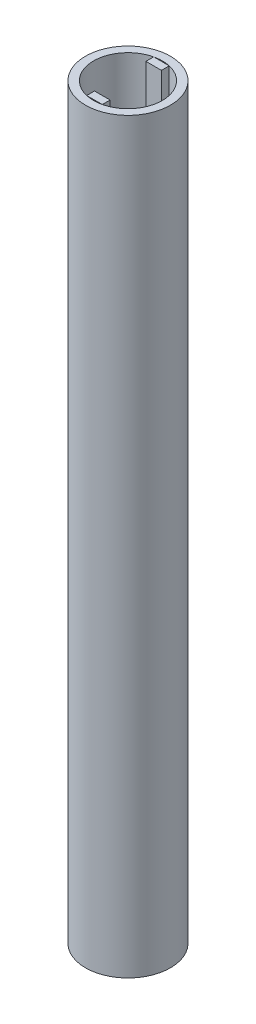
ISO-10303-21;
HEADER;
FILE_DESCRIPTION(('STEP AP214'),'2;1');
FILE_NAME('part.step','',(''),(''),'','','');
FILE_SCHEMA(('AUTOMOTIVE_DESIGN { 1 0 10303 214 1 1 1 1 }'));
ENDSEC;
DATA;
#1=APPLICATION_CONTEXT('core data for automotive mechanical design processes');
#2=APPLICATION_PROTOCOL_DEFINITION('international standard','automotive_design',2000,#1);
#3=PRODUCT_CONTEXT('',#1,'mechanical');
#4=PRODUCT('Part','Part','',(#3));
#5=PRODUCT_RELATED_PRODUCT_CATEGORY('part','',(#4));
#6=PRODUCT_DEFINITION_FORMATION('','',#4);
#7=PRODUCT_DEFINITION_CONTEXT('part definition',#1,'design');
#8=PRODUCT_DEFINITION('design','',#6,#7);
#9=PRODUCT_DEFINITION_SHAPE('','',#8);
#10=(LENGTH_UNIT() NAMED_UNIT(*) SI_UNIT(.MILLI.,.METRE.));
#11=(NAMED_UNIT(*) PLANE_ANGLE_UNIT() SI_UNIT($,.RADIAN.));
#12=(NAMED_UNIT(*) SI_UNIT($,.STERADIAN.) SOLID_ANGLE_UNIT());
#13=UNCERTAINTY_MEASURE_WITH_UNIT(LENGTH_MEASURE(1.E-05),#10,'distance_accuracy_value','');
#14=(GEOMETRIC_REPRESENTATION_CONTEXT(3) GLOBAL_UNCERTAINTY_ASSIGNED_CONTEXT((#13)) GLOBAL_UNIT_ASSIGNED_CONTEXT((#10,
#11,#12)) REPRESENTATION_CONTEXT('',''));
#15=CARTESIAN_POINT('',(0.,0.,0.));
#16=DIRECTION('',(0.,0.,1.));
#17=DIRECTION('',(1.,0.,0.));
#18=AXIS2_PLACEMENT_3D('',#15,#16,#17);
#19=CARTESIAN_POINT('',(6.35,482.6,27.3131622219032));
#20=DIRECTION('',(1.,0.,0.));
#21=DIRECTION('',(0.,0.,-1.));
#22=AXIS2_PLACEMENT_3D('',#19,#20,#21);
#23=PLANE('',#22);
#24=DIRECTION('',(0.,0.,-1.));
#25=VECTOR('',#24,1.);
#26=CARTESIAN_POINT('',(6.35,495.3,34.6593));
#27=LINE('',#26,#25);
#28=CARTESIAN_POINT('',(6.35,495.3,27.3131622219032));
#29=VERTEX_POINT('',#28);
#30=CARTESIAN_POINT('',(6.35,495.3,20.9631622219032));
#31=VERTEX_POINT('',#30);
#32=EDGE_CURVE('E108',#29,#31,#27,.T.);
#33=ORIENTED_EDGE('',*,*,#32,.T.);
#34=DIRECTION('',(0.,1.,0.));
#35=VECTOR('',#34,1.);
#36=CARTESIAN_POINT('',(6.35,482.6,20.9631622219032));
#37=LINE('',#36,#35);
#38=CARTESIAN_POINT('',(6.35,609.6,20.9631622219032));
#39=VERTEX_POINT('',#38);
#40=EDGE_CURVE('E47',#31,#39,#37,.T.);
#41=ORIENTED_EDGE('',*,*,#40,.T.);
#42=DIRECTION('',(0.,0.,-1.));
#43=VECTOR('',#42,1.);
#44=CARTESIAN_POINT('',(6.35,609.6,27.3131622219032));
#45=LINE('',#44,#43);
#46=CARTESIAN_POINT('',(6.35,609.6,27.3131622219032));
#47=VERTEX_POINT('',#46);
#48=EDGE_CURVE('E106',#47,#39,#45,.T.);
#49=ORIENTED_EDGE('',*,*,#48,.F.);
#50=DIRECTION('',(0.,1.,0.));
#51=VECTOR('',#50,1.);
#52=CARTESIAN_POINT('',(6.35,482.6,27.3131622219032));
#53=LINE('',#52,#51);
#54=EDGE_CURVE('E12',#29,#47,#53,.T.);
#55=ORIENTED_EDGE('',*,*,#54,.F.);
#56=EDGE_LOOP('',(#33,#41,#49,#55));
#57=FACE_BOUND('',#56,.T.);
#58=ADVANCED_FACE('F44',(#57),#23,.T.);
#59=CARTESIAN_POINT('',(6.35,482.6,27.3131622219032));
#60=DIRECTION('',(0.,0.,1.));
#61=DIRECTION('',(1.,0.,0.));
#62=AXIS2_PLACEMENT_3D('',#59,#60,#61);
#63=PLANE('',#62);
#64=DIRECTION('',(0.707106781186548,0.707106781186547,0.));
#65=VECTOR('',#64,1.);
#66=CARTESIAN_POINT('',(6.35,495.3,27.3131622219032));
#67=LINE('',#66,#65);
#68=CARTESIAN_POINT('',(-6.35,482.6,27.3131622219032));
#69=VERTEX_POINT('',#68);
#70=EDGE_CURVE('E61',#69,#29,#67,.T.);
#71=ORIENTED_EDGE('',*,*,#70,.T.);
#72=ORIENTED_EDGE('',*,*,#54,.T.);
#73=DIRECTION('',(1.,0.,0.));
#74=VECTOR('',#73,1.);
#75=CARTESIAN_POINT('',(6.35,609.6,27.3131622219032));
#76=LINE('',#75,#74);
#77=CARTESIAN_POINT('',(-6.35,609.6,27.3131622219032));
#78=VERTEX_POINT('',#77);
#79=EDGE_CURVE('E91',#78,#47,#76,.T.);
#80=ORIENTED_EDGE('',*,*,#79,.F.);
#81=DIRECTION('',(0.,1.,0.));
#82=VECTOR('',#81,1.);
#83=CARTESIAN_POINT('',(-6.35,482.6,27.3131622219032));
#84=LINE('',#83,#82);
#85=EDGE_CURVE('E53',#69,#78,#84,.T.);
#86=ORIENTED_EDGE('',*,*,#85,.F.);
#87=EDGE_LOOP('',(#71,#72,#80,#86));
#88=FACE_BOUND('',#87,.T.);
#89=ADVANCED_FACE('F95',(#88),#63,.T.);
#90=CARTESIAN_POINT('',(-6.35,482.6,27.3131622219032));
#91=DIRECTION('',(-1.,0.,0.));
#92=DIRECTION('',(0.,0.,1.));
#93=AXIS2_PLACEMENT_3D('',#90,#91,#92);
#94=PLANE('',#93);
#95=DIRECTION('',(0.,0.,1.));
#96=VECTOR('',#95,1.);
#97=CARTESIAN_POINT('',(-6.35,609.6,27.3131622219032));
#98=LINE('',#97,#96);
#99=CARTESIAN_POINT('',(-6.35,609.6,20.9631622219032));
#100=VERTEX_POINT('',#99);
#101=EDGE_CURVE('E80',#100,#78,#98,.T.);
#102=ORIENTED_EDGE('',*,*,#101,.F.);
#103=DIRECTION('',(0.,1.,0.));
#104=VECTOR('',#103,1.);
#105=CARTESIAN_POINT('',(-6.35,482.6,20.9631622219032));
#106=LINE('',#105,#104);
#107=CARTESIAN_POINT('',(-6.35,482.6,20.9631622219032));
#108=VERTEX_POINT('',#107);
#109=EDGE_CURVE('E85',#108,#100,#106,.T.);
#110=ORIENTED_EDGE('',*,*,#109,.F.);
#111=DIRECTION('',(0.,0.,1.));
#112=VECTOR('',#111,1.);
#113=CARTESIAN_POINT('',(-6.35,482.6,27.3131622219032));
#114=LINE('',#113,#112);
#115=EDGE_CURVE('E82',#108,#69,#114,.T.);
#116=ORIENTED_EDGE('',*,*,#115,.T.);
#117=ORIENTED_EDGE('',*,*,#85,.T.);
#118=EDGE_LOOP('',(#102,#110,#116,#117));
#119=FACE_BOUND('',#118,.T.);
#120=ADVANCED_FACE('F78',(#119),#94,.T.);
#121=CARTESIAN_POINT('',(6.35,482.6,20.9631622219032));
#122=DIRECTION('',(0.,0.,-1.));
#123=DIRECTION('',(-1.,0.,0.));
#124=AXIS2_PLACEMENT_3D('',#121,#122,#123);
#125=PLANE('',#124);
#126=DIRECTION('',(0.707106781186548,0.707106781186547,0.));
#127=VECTOR('',#126,1.);
#128=CARTESIAN_POINT('',(6.35,495.3,20.9631622219032));
#129=LINE('',#128,#127);
#130=EDGE_CURVE('E111',#108,#31,#129,.T.);
#131=ORIENTED_EDGE('',*,*,#130,.F.);
#132=ORIENTED_EDGE('',*,*,#109,.T.);
#133=DIRECTION('',(-1.,0.,0.));
#134=VECTOR('',#133,1.);
#135=CARTESIAN_POINT('',(6.35,609.6,20.9631622219032));
#136=LINE('',#135,#134);
#137=EDGE_CURVE('E93',#39,#100,#136,.T.);
#138=ORIENTED_EDGE('',*,*,#137,.F.);
#139=ORIENTED_EDGE('',*,*,#40,.F.);
#140=EDGE_LOOP('',(#131,#132,#138,#139));
#141=FACE_BOUND('',#140,.T.);
#142=ADVANCED_FACE('F109',(#141),#125,.T.);
#143=CARTESIAN_POINT('',(6.35,609.6,20.9631622219032));
#144=DIRECTION('',(0.,1.,0.));
#145=DIRECTION('',(0.,0.,-1.));
#146=AXIS2_PLACEMENT_3D('',#143,#144,#145);
#147=PLANE('',#146);
#148=ORIENTED_EDGE('',*,*,#48,.T.);
#149=ORIENTED_EDGE('',*,*,#137,.T.);
#150=ORIENTED_EDGE('',*,*,#101,.T.);
#151=ORIENTED_EDGE('',*,*,#79,.T.);
#152=EDGE_LOOP('',(#148,#149,#150,#151));
#153=FACE_BOUND('',#152,.T.);
#154=ADVANCED_FACE('F90',(#153),#147,.T.);
#155=CARTESIAN_POINT('',(6.35,495.3,34.6593));
#156=DIRECTION('',(-0.707106781186547,0.707106781186548,0.));
#157=DIRECTION('',(0.707106781186548,0.707106781186547,0.));
#158=AXIS2_PLACEMENT_3D('',#155,#156,#157);
#159=PLANE('',#158);
#160=ORIENTED_EDGE('',*,*,#115,.F.);
#161=ORIENTED_EDGE('',*,*,#130,.T.);
#162=ORIENTED_EDGE('',*,*,#32,.F.);
#163=ORIENTED_EDGE('',*,*,#70,.F.);
#164=EDGE_LOOP('',(#160,#161,#162,#163));
#165=FACE_BOUND('',#164,.T.);
#166=ADVANCED_FACE('F118',(#165),#159,.F.);
#167=CLOSED_SHELL('',(#58,#89,#120,#142,#154,#166));
#168=MANIFOLD_SOLID_BREP('B2',#167);
#169=CARTESIAN_POINT('',(-6.35,482.6,-27.3131622219032));
#170=DIRECTION('',(-1.,0.,0.));
#171=DIRECTION('',(0.,0.,1.));
#172=AXIS2_PLACEMENT_3D('',#169,#170,#171);
#173=PLANE('',#172);
#174=DIRECTION('',(0.,0.,1.));
#175=VECTOR('',#174,1.);
#176=CARTESIAN_POINT('',(-6.35,495.3,-34.6593));
#177=LINE('',#176,#175);
#178=CARTESIAN_POINT('',(-6.35,495.3,-27.3131622219032));
#179=VERTEX_POINT('',#178);
#180=CARTESIAN_POINT('',(-6.35,495.3,-20.9631622219032));
#181=VERTEX_POINT('',#180);
#182=EDGE_CURVE('E239',#179,#181,#177,.T.);
#183=ORIENTED_EDGE('',*,*,#182,.T.);
#184=DIRECTION('',(0.,1.,0.));
#185=VECTOR('',#184,1.);
#186=CARTESIAN_POINT('',(-6.35,482.6,-20.9631622219032));
#187=LINE('',#186,#185);
#188=CARTESIAN_POINT('',(-6.35,609.6,-20.9631622219032));
#189=VERTEX_POINT('',#188);
#190=EDGE_CURVE('E178',#181,#189,#187,.T.);
#191=ORIENTED_EDGE('',*,*,#190,.T.);
#192=DIRECTION('',(0.,0.,1.));
#193=VECTOR('',#192,1.);
#194=CARTESIAN_POINT('',(-6.35,609.6,-27.3131622219032));
#195=LINE('',#194,#193);
#196=CARTESIAN_POINT('',(-6.35,609.6,-27.3131622219032));
#197=VERTEX_POINT('',#196);
#198=EDGE_CURVE('E237',#197,#189,#195,.T.);
#199=ORIENTED_EDGE('',*,*,#198,.F.);
#200=DIRECTION('',(0.,1.,0.));
#201=VECTOR('',#200,1.);
#202=CARTESIAN_POINT('',(-6.35,482.6,-27.3131622219032));
#203=LINE('',#202,#201);
#204=EDGE_CURVE('E42',#179,#197,#203,.T.);
#205=ORIENTED_EDGE('',*,*,#204,.F.);
#206=EDGE_LOOP('',(#183,#191,#199,#205));
#207=FACE_BOUND('',#206,.T.);
#208=ADVANCED_FACE('F175',(#207),#173,.T.);
#209=CARTESIAN_POINT('',(-6.35,482.6,-27.3131622219032));
#210=DIRECTION('',(0.,0.,-1.));
#211=DIRECTION('',(-1.,0.,0.));
#212=AXIS2_PLACEMENT_3D('',#209,#210,#211);
#213=PLANE('',#212);
#214=DIRECTION('',(-0.707106781186548,0.707106781186547,0.));
#215=VECTOR('',#214,1.);
#216=CARTESIAN_POINT('',(-6.35,495.3,-27.3131622219032));
#217=LINE('',#216,#215);
#218=CARTESIAN_POINT('',(6.35,482.6,-27.3131622219032));
#219=VERTEX_POINT('',#218);
#220=EDGE_CURVE('E192',#219,#179,#217,.T.);
#221=ORIENTED_EDGE('',*,*,#220,.T.);
#222=ORIENTED_EDGE('',*,*,#204,.T.);
#223=DIRECTION('',(-1.,0.,0.));
#224=VECTOR('',#223,1.);
#225=CARTESIAN_POINT('',(-6.35,609.6,-27.3131622219032));
#226=LINE('',#225,#224);
#227=CARTESIAN_POINT('',(6.35,609.6,-27.3131622219032));
#228=VERTEX_POINT('',#227);
#229=EDGE_CURVE('E222',#228,#197,#226,.T.);
#230=ORIENTED_EDGE('',*,*,#229,.F.);
#231=DIRECTION('',(0.,1.,0.));
#232=VECTOR('',#231,1.);
#233=CARTESIAN_POINT('',(6.35,482.6,-27.3131622219032));
#234=LINE('',#233,#232);
#235=EDGE_CURVE('E184',#219,#228,#234,.T.);
#236=ORIENTED_EDGE('',*,*,#235,.F.);
#237=EDGE_LOOP('',(#221,#222,#230,#236));
#238=FACE_BOUND('',#237,.T.);
#239=ADVANCED_FACE('F226',(#238),#213,.T.);
#240=CARTESIAN_POINT('',(6.35,482.6,-27.3131622219032));
#241=DIRECTION('',(1.,0.,0.));
#242=DIRECTION('',(0.,0.,-1.));
#243=AXIS2_PLACEMENT_3D('',#240,#241,#242);
#244=PLANE('',#243);
#245=DIRECTION('',(0.,0.,-1.));
#246=VECTOR('',#245,1.);
#247=CARTESIAN_POINT('',(6.35,609.6,-27.3131622219032));
#248=LINE('',#247,#246);
#249=CARTESIAN_POINT('',(6.35,609.6,-20.9631622219032));
#250=VERTEX_POINT('',#249);
#251=EDGE_CURVE('E211',#250,#228,#248,.T.);
#252=ORIENTED_EDGE('',*,*,#251,.F.);
#253=DIRECTION('',(0.,1.,0.));
#254=VECTOR('',#253,1.);
#255=CARTESIAN_POINT('',(6.35,482.6,-20.9631622219032));
#256=LINE('',#255,#254);
#257=CARTESIAN_POINT('',(6.35,482.6,-20.9631622219032));
#258=VERTEX_POINT('',#257);
#259=EDGE_CURVE('E216',#258,#250,#256,.T.);
#260=ORIENTED_EDGE('',*,*,#259,.F.);
#261=DIRECTION('',(0.,0.,-1.));
#262=VECTOR('',#261,1.);
#263=CARTESIAN_POINT('',(6.35,482.6,-27.3131622219032));
#264=LINE('',#263,#262);
#265=EDGE_CURVE('E213',#258,#219,#264,.T.);
#266=ORIENTED_EDGE('',*,*,#265,.T.);
#267=ORIENTED_EDGE('',*,*,#235,.T.);
#268=EDGE_LOOP('',(#252,#260,#266,#267));
#269=FACE_BOUND('',#268,.T.);
#270=ADVANCED_FACE('F209',(#269),#244,.T.);
#271=CARTESIAN_POINT('',(-6.35,482.6,-20.9631622219032));
#272=DIRECTION('',(0.,0.,1.));
#273=DIRECTION('',(1.,0.,0.));
#274=AXIS2_PLACEMENT_3D('',#271,#272,#273);
#275=PLANE('',#274);
#276=DIRECTION('',(-0.707106781186548,0.707106781186547,0.));
#277=VECTOR('',#276,1.);
#278=CARTESIAN_POINT('',(-6.35,495.3,-20.9631622219032));
#279=LINE('',#278,#277);
#280=EDGE_CURVE('E242',#258,#181,#279,.T.);
#281=ORIENTED_EDGE('',*,*,#280,.F.);
#282=ORIENTED_EDGE('',*,*,#259,.T.);
#283=DIRECTION('',(1.,0.,0.));
#284=VECTOR('',#283,1.);
#285=CARTESIAN_POINT('',(-6.35,609.6,-20.9631622219032));
#286=LINE('',#285,#284);
#287=EDGE_CURVE('E224',#189,#250,#286,.T.);
#288=ORIENTED_EDGE('',*,*,#287,.F.);
#289=ORIENTED_EDGE('',*,*,#190,.F.);
#290=EDGE_LOOP('',(#281,#282,#288,#289));
#291=FACE_BOUND('',#290,.T.);
#292=ADVANCED_FACE('F240',(#291),#275,.T.);
#293=CARTESIAN_POINT('',(-6.35,609.6,-20.9631622219032));
#294=DIRECTION('',(0.,1.,0.));
#295=DIRECTION('',(0.,0.,1.));
#296=AXIS2_PLACEMENT_3D('',#293,#294,#295);
#297=PLANE('',#296);
#298=ORIENTED_EDGE('',*,*,#198,.T.);
#299=ORIENTED_EDGE('',*,*,#287,.T.);
#300=ORIENTED_EDGE('',*,*,#251,.T.);
#301=ORIENTED_EDGE('',*,*,#229,.T.);
#302=EDGE_LOOP('',(#298,#299,#300,#301));
#303=FACE_BOUND('',#302,.T.);
#304=ADVANCED_FACE('F221',(#303),#297,.T.);
#305=CARTESIAN_POINT('',(-6.35,495.3,-34.6593));
#306=DIRECTION('',(0.707106781186547,0.707106781186548,0.));
#307=DIRECTION('',(-0.707106781186548,0.707106781186547,0.));
#308=AXIS2_PLACEMENT_3D('',#305,#306,#307);
#309=PLANE('',#308);
#310=ORIENTED_EDGE('',*,*,#265,.F.);
#311=ORIENTED_EDGE('',*,*,#280,.T.);
#312=ORIENTED_EDGE('',*,*,#182,.F.);
#313=ORIENTED_EDGE('',*,*,#220,.F.);
#314=EDGE_LOOP('',(#310,#311,#312,#313));
#315=FACE_BOUND('',#314,.T.);
#316=ADVANCED_FACE('F249',(#315),#309,.F.);
#317=CLOSED_SHELL('',(#208,#239,#270,#292,#304,#316));
#318=MANIFOLD_SOLID_BREP('B6',#317);
#319=CARTESIAN_POINT('',(0.,609.6,0.));
#320=DIRECTION('',(0.,1.,0.));
#321=DIRECTION('',(0.,0.,1.));
#322=AXIS2_PLACEMENT_3D('',#319,#320,#321);
#323=PLANE('',#322);
#324=CARTESIAN_POINT('',(0.,609.6,0.));
#325=DIRECTION('',(0.,1.,0.));
#326=DIRECTION('',(0.,0.,1.));
#327=AXIS2_PLACEMENT_3D('',#324,#325,#326);
#328=CIRCLE('',#327,34.6583);
#329=CARTESIAN_POINT('',(0.,609.6,34.6583));
#330=VERTEX_POINT('',#329);
#331=EDGE_CURVE('E174',#330,#330,#328,.T.);
#332=ORIENTED_EDGE('',*,*,#331,.T.);
#333=EDGE_LOOP('',(#332));
#334=FACE_BOUND('',#333,.T.);
#335=CARTESIAN_POINT('',(0.,609.6,0.));
#336=DIRECTION('',(0.,1.,0.));
#337=DIRECTION('',(0.,0.,1.));
#338=AXIS2_PLACEMENT_3D('',#335,#336,#337);
#339=CIRCLE('',#338,28.0416);
#340=CARTESIAN_POINT('',(0.,609.6,28.0416));
#341=VERTEX_POINT('',#340);
#342=EDGE_CURVE('E310',#341,#341,#339,.T.);
#343=ORIENTED_EDGE('',*,*,#342,.F.);
#344=EDGE_LOOP('',(#343));
#345=FACE_BOUND('',#344,.T.);
#346=ADVANCED_FACE('F299',(#334,#345),#323,.T.);
#347=CARTESIAN_POINT('',(0.,0.,0.));
#348=DIRECTION('',(0.,1.,0.));
#349=DIRECTION('',(0.,0.,1.));
#350=AXIS2_PLACEMENT_3D('',#347,#348,#349);
#351=PLANE('',#350);
#352=CARTESIAN_POINT('',(0.,0.,0.));
#353=DIRECTION('',(0.,1.,0.));
#354=DIRECTION('',(0.,0.,1.));
#355=AXIS2_PLACEMENT_3D('',#352,#353,#354);
#356=CIRCLE('',#355,34.6583);
#357=CARTESIAN_POINT('',(0.,0.,34.6583));
#358=VERTEX_POINT('',#357);
#359=EDGE_CURVE('E303',#358,#358,#356,.T.);
#360=ORIENTED_EDGE('',*,*,#359,.F.);
#361=EDGE_LOOP('',(#360));
#362=FACE_BOUND('',#361,.T.);
#363=CARTESIAN_POINT('',(0.,0.,0.));
#364=DIRECTION('',(0.,1.,0.));
#365=DIRECTION('',(0.,0.,1.));
#366=AXIS2_PLACEMENT_3D('',#363,#364,#365);
#367=CIRCLE('',#366,28.0416);
#368=CARTESIAN_POINT('',(0.,0.,28.0416));
#369=VERTEX_POINT('',#368);
#370=EDGE_CURVE('E312',#369,#369,#367,.T.);
#371=ORIENTED_EDGE('',*,*,#370,.T.);
#372=EDGE_LOOP('',(#371));
#373=FACE_BOUND('',#372,.T.);
#374=ADVANCED_FACE('F322',(#362,#373),#351,.F.);
#375=CARTESIAN_POINT('',(0.,609.6,0.));
#376=DIRECTION('',(0.,-1.,0.));
#377=DIRECTION('',(0.,0.,-1.));
#378=AXIS2_PLACEMENT_3D('',#375,#376,#377);
#379=CYLINDRICAL_SURFACE('',#378,34.6583);
#380=ORIENTED_EDGE('',*,*,#331,.F.);
#381=EDGE_LOOP('',(#380));
#382=FACE_BOUND('',#381,.T.);
#383=ORIENTED_EDGE('',*,*,#359,.T.);
#384=EDGE_LOOP('',(#383));
#385=FACE_BOUND('',#384,.T.);
#386=ADVANCED_FACE('F301',(#382,#385),#379,.T.);
#387=CARTESIAN_POINT('',(0.,609.6,0.));
#388=DIRECTION('',(0.,-1.,0.));
#389=DIRECTION('',(0.,0.,-1.));
#390=AXIS2_PLACEMENT_3D('',#387,#388,#389);
#391=CYLINDRICAL_SURFACE('',#390,28.0416);
#392=ORIENTED_EDGE('',*,*,#342,.T.);
#393=EDGE_LOOP('',(#392));
#394=FACE_BOUND('',#393,.T.);
#395=ORIENTED_EDGE('',*,*,#370,.F.);
#396=EDGE_LOOP('',(#395));
#397=FACE_BOUND('',#396,.T.);
#398=ADVANCED_FACE('F318',(#394,#397),#391,.F.);
#399=CLOSED_SHELL('',(#346,#374,#386,#398));
#400=MANIFOLD_SOLID_BREP('B36',#399);
#401=ADVANCED_BREP_SHAPE_REPRESENTATION('',(#18,#168,#318,#400),#14);
#402=SHAPE_DEFINITION_REPRESENTATION(#9,#401);
ENDSEC;
END-ISO-10303-21;
